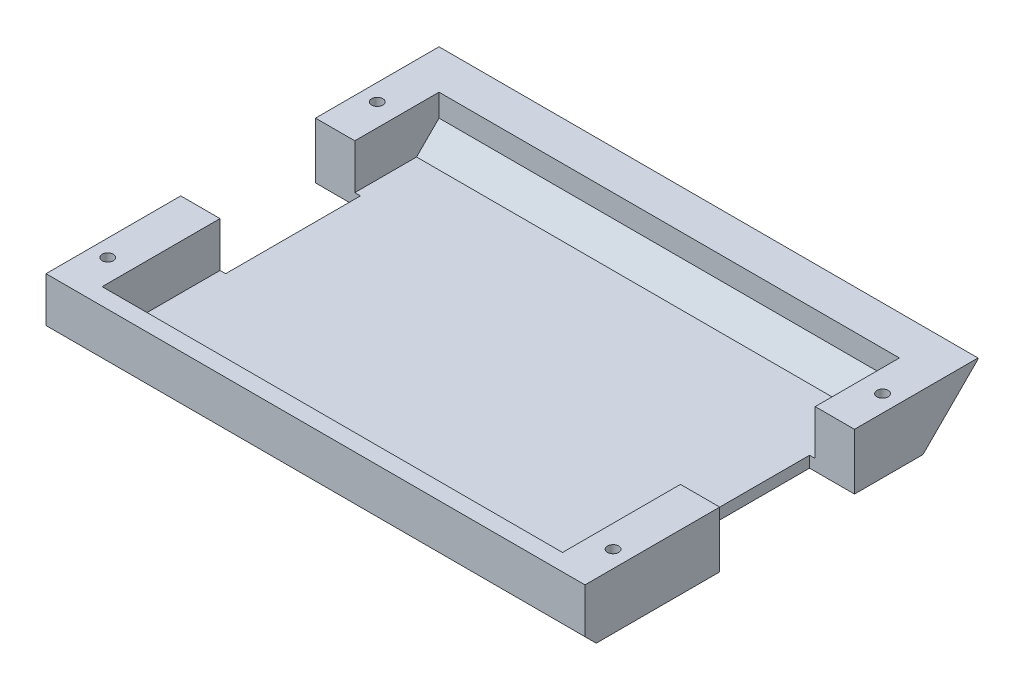
ISO-10303-21;
HEADER;
FILE_DESCRIPTION(('STEP AP214'),'2;1');
FILE_NAME('part.step','',(''),(''),'','','');
FILE_SCHEMA(('AUTOMOTIVE_DESIGN { 1 0 10303 214 1 1 1 1 }'));
ENDSEC;
DATA;
#1=APPLICATION_CONTEXT('core data for automotive mechanical design processes');
#2=APPLICATION_PROTOCOL_DEFINITION('international standard','automotive_design',2000,#1);
#3=PRODUCT_CONTEXT('',#1,'mechanical');
#4=PRODUCT('Part','Part','',(#3));
#5=PRODUCT_RELATED_PRODUCT_CATEGORY('part','',(#4));
#6=PRODUCT_DEFINITION_FORMATION('','',#4);
#7=PRODUCT_DEFINITION_CONTEXT('part definition',#1,'design');
#8=PRODUCT_DEFINITION('design','',#6,#7);
#9=PRODUCT_DEFINITION_SHAPE('','',#8);
#10=(LENGTH_UNIT() NAMED_UNIT(*) SI_UNIT(.MILLI.,.METRE.));
#11=(NAMED_UNIT(*) PLANE_ANGLE_UNIT() SI_UNIT($,.RADIAN.));
#12=(NAMED_UNIT(*) SI_UNIT($,.STERADIAN.) SOLID_ANGLE_UNIT());
#13=UNCERTAINTY_MEASURE_WITH_UNIT(LENGTH_MEASURE(1.E-05),#10,'distance_accuracy_value','');
#14=(GEOMETRIC_REPRESENTATION_CONTEXT(3) GLOBAL_UNCERTAINTY_ASSIGNED_CONTEXT((#13)) GLOBAL_UNIT_ASSIGNED_CONTEXT((#10,
#11,#12)) REPRESENTATION_CONTEXT('',''));
#15=CARTESIAN_POINT('',(0.,0.,0.));
#16=DIRECTION('',(0.,0.,1.));
#17=DIRECTION('',(1.,0.,0.));
#18=AXIS2_PLACEMENT_3D('',#15,#16,#17);
#19=CARTESIAN_POINT('',(-24.,5.,17.5));
#20=DIRECTION('',(1.,0.,0.));
#21=DIRECTION('',(0.,0.,-1.));
#22=AXIS2_PLACEMENT_3D('',#19,#20,#21);
#23=PLANE('',#22);
#24=DIRECTION('',(0.,-1.,0.));
#25=VECTOR('',#24,1.);
#26=CARTESIAN_POINT('',(-24.,5.,-17.5));
#27=LINE('',#26,#25);
#28=CARTESIAN_POINT('',(-24.,5.,-17.5));
#29=VERTEX_POINT('',#28);
#30=CARTESIAN_POINT('',(-24.,4.9,-17.5));
#31=VERTEX_POINT('',#30);
#32=EDGE_CURVE('E238',#29,#31,#27,.T.);
#33=ORIENTED_EDGE('',*,*,#32,.T.);
#34=DIRECTION('',(0.,0.707106781186547,-0.707106781186549));
#35=VECTOR('',#34,1.);
#36=CARTESIAN_POINT('',(-24.,4.9,-17.5));
#37=LINE('',#36,#35);
#38=CARTESIAN_POINT('',(-24.,0.,-12.6));
#39=VERTEX_POINT('',#38);
#40=EDGE_CURVE('E296',#31,#39,#37,.F.);
#41=ORIENTED_EDGE('',*,*,#40,.T.);
#42=DIRECTION('',(0.,0.,1.));
#43=VECTOR('',#42,1.);
#44=CARTESIAN_POINT('',(-24.,0.,17.5));
#45=LINE('',#44,#43);
#46=CARTESIAN_POINT('',(-24.,0.,-6.5));
#47=VERTEX_POINT('',#46);
#48=EDGE_CURVE('E223',#39,#47,#45,.T.);
#49=ORIENTED_EDGE('',*,*,#48,.T.);
#50=DIRECTION('',(0.,1.,0.));
#51=VECTOR('',#50,1.);
#52=CARTESIAN_POINT('',(-24.,0.,-6.5));
#53=LINE('',#52,#51);
#54=CARTESIAN_POINT('',(-24.,5.,-6.5));
#55=VERTEX_POINT('',#54);
#56=EDGE_CURVE('E361',#47,#55,#53,.T.);
#57=ORIENTED_EDGE('',*,*,#56,.T.);
#58=DIRECTION('',(0.,0.,1.));
#59=VECTOR('',#58,1.);
#60=CARTESIAN_POINT('',(-24.,5.,17.5));
#61=LINE('',#60,#59);
#62=EDGE_CURVE('E332',#29,#55,#61,.T.);
#63=ORIENTED_EDGE('',*,*,#62,.F.);
#64=EDGE_LOOP('',(#33,#41,#49,#57,#63));
#65=FACE_BOUND('',#64,.T.);
#66=ADVANCED_FACE('F39',(#65),#23,.F.);
#67=CARTESIAN_POINT('',(24.,5.,17.5));
#68=DIRECTION('',(-1.,0.,0.));
#69=DIRECTION('',(0.,0.,1.));
#70=AXIS2_PLACEMENT_3D('',#67,#68,#69);
#71=PLANE('',#70);
#72=DIRECTION('',(0.,0.,-1.));
#73=VECTOR('',#72,1.);
#74=CARTESIAN_POINT('',(24.,0.,17.5));
#75=LINE('',#74,#73);
#76=CARTESIAN_POINT('',(24.,0.,-6.5));
#77=VERTEX_POINT('',#76);
#78=CARTESIAN_POINT('',(24.,0.,-12.6));
#79=VERTEX_POINT('',#78);
#80=EDGE_CURVE('E228',#77,#79,#75,.T.);
#81=ORIENTED_EDGE('',*,*,#80,.T.);
#82=DIRECTION('',(0.,-0.707106781186547,0.707106781186549));
#83=VECTOR('',#82,1.);
#84=CARTESIAN_POINT('',(24.,4.9,-17.5));
#85=LINE('',#84,#83);
#86=CARTESIAN_POINT('',(24.,4.9,-17.5));
#87=VERTEX_POINT('',#86);
#88=EDGE_CURVE('E302',#79,#87,#85,.F.);
#89=ORIENTED_EDGE('',*,*,#88,.T.);
#90=DIRECTION('',(0.,-1.,0.));
#91=VECTOR('',#90,1.);
#92=CARTESIAN_POINT('',(24.,5.,-17.5));
#93=LINE('',#92,#91);
#94=CARTESIAN_POINT('',(24.,5.,-17.5));
#95=VERTEX_POINT('',#94);
#96=EDGE_CURVE('E242',#95,#87,#93,.T.);
#97=ORIENTED_EDGE('',*,*,#96,.F.);
#98=DIRECTION('',(0.,0.,-1.));
#99=VECTOR('',#98,1.);
#100=CARTESIAN_POINT('',(24.,5.,17.5));
#101=LINE('',#100,#99);
#102=CARTESIAN_POINT('',(24.,5.,-6.5));
#103=VERTEX_POINT('',#102);
#104=EDGE_CURVE('E328',#103,#95,#101,.T.);
#105=ORIENTED_EDGE('',*,*,#104,.F.);
#106=DIRECTION('',(0.,1.,0.));
#107=VECTOR('',#106,1.);
#108=CARTESIAN_POINT('',(24.,0.,-6.5));
#109=LINE('',#108,#107);
#110=EDGE_CURVE('E346',#77,#103,#109,.T.);
#111=ORIENTED_EDGE('',*,*,#110,.F.);
#112=EDGE_LOOP('',(#81,#89,#97,#105,#111));
#113=FACE_BOUND('',#112,.T.);
#114=ADVANCED_FACE('F343',(#113),#71,.F.);
#115=CARTESIAN_POINT('',(0.,5.,0.));
#116=DIRECTION('',(0.,1.,0.));
#117=DIRECTION('',(0.,0.,1.));
#118=AXIS2_PLACEMENT_3D('',#115,#116,#117);
#119=PLANE('',#118);
#120=DIRECTION('',(-1.,0.,0.));
#121=VECTOR('',#120,1.);
#122=CARTESIAN_POINT('',(-20.,5.,-6.5));
#123=LINE('',#122,#121);
#124=CARTESIAN_POINT('',(-20.5,5.,-6.5));
#125=VERTEX_POINT('',#124);
#126=EDGE_CURVE('E205',#125,#55,#123,.T.);
#127=ORIENTED_EDGE('',*,*,#126,.F.);
#128=DIRECTION('',(0.,0.,1.));
#129=VECTOR('',#128,1.);
#130=CARTESIAN_POINT('',(-20.5,5.,16.));
#131=LINE('',#130,#129);
#132=CARTESIAN_POINT('',(-20.5,5.,-14.));
#133=VERTEX_POINT('',#132);
#134=EDGE_CURVE('E479',#133,#125,#131,.T.);
#135=ORIENTED_EDGE('',*,*,#134,.F.);
#136=DIRECTION('',(-1.,0.,0.));
#137=VECTOR('',#136,1.);
#138=CARTESIAN_POINT('',(20.5,5.,-14.));
#139=LINE('',#138,#137);
#140=CARTESIAN_POINT('',(20.5,5.,-14.));
#141=VERTEX_POINT('',#140);
#142=EDGE_CURVE('E490',#141,#133,#139,.T.);
#143=ORIENTED_EDGE('',*,*,#142,.F.);
#144=DIRECTION('',(0.,0.,-1.));
#145=VECTOR('',#144,1.);
#146=CARTESIAN_POINT('',(20.5,5.,16.));
#147=LINE('',#146,#145);
#148=CARTESIAN_POINT('',(20.5,5.,-6.5));
#149=VERTEX_POINT('',#148);
#150=EDGE_CURVE('E373',#149,#141,#147,.T.);
#151=ORIENTED_EDGE('',*,*,#150,.F.);
#152=DIRECTION('',(-1.,0.,0.));
#153=VECTOR('',#152,1.);
#154=CARTESIAN_POINT('',(20.,5.,-6.5));
#155=LINE('',#154,#153);
#156=EDGE_CURVE('E370',#103,#149,#155,.T.);
#157=ORIENTED_EDGE('',*,*,#156,.F.);
#158=ORIENTED_EDGE('',*,*,#104,.T.);
#159=DIRECTION('',(-1.,0.,0.));
#160=VECTOR('',#159,1.);
#161=CARTESIAN_POINT('',(24.,5.,-17.5));
#162=LINE('',#161,#160);
#163=EDGE_CURVE('E233',#95,#29,#162,.T.);
#164=ORIENTED_EDGE('',*,*,#163,.T.);
#165=ORIENTED_EDGE('',*,*,#62,.T.);
#166=EDGE_LOOP('',(#127,#135,#143,#151,#157,#158,#164,#165));
#167=FACE_BOUND('',#166,.T.);
#168=CARTESIAN_POINT('',(-22.5,5.,-10.5));
#169=DIRECTION('',(0.,1.,0.));
#170=DIRECTION('',(0.,0.,1.));
#171=AXIS2_PLACEMENT_3D('',#168,#169,#170);
#172=CIRCLE('',#171,0.499999999999999);
#173=CARTESIAN_POINT('',(-22.5,5.,-10.));
#174=VERTEX_POINT('',#173);
#175=EDGE_CURVE('E453',#174,#174,#172,.T.);
#176=ORIENTED_EDGE('',*,*,#175,.F.);
#177=EDGE_LOOP('',(#176));
#178=FACE_BOUND('',#177,.T.);
#179=CARTESIAN_POINT('',(22.5,5.,-10.5));
#180=DIRECTION('',(0.,1.,0.));
#181=DIRECTION('',(0.,0.,-1.));
#182=AXIS2_PLACEMENT_3D('',#179,#180,#181);
#183=CIRCLE('',#182,0.499999999999999);
#184=CARTESIAN_POINT('',(22.5,5.,-11.));
#185=VERTEX_POINT('',#184);
#186=EDGE_CURVE('E454',#185,#185,#183,.T.);
#187=ORIENTED_EDGE('',*,*,#186,.F.);
#188=EDGE_LOOP('',(#187));
#189=FACE_BOUND('',#188,.T.);
#190=ADVANCED_FACE('F364',(#167,#178,#189),#119,.T.);
#191=CARTESIAN_POINT('',(-20.5,1.,16.));
#192=DIRECTION('',(-1.,0.,0.));
#193=DIRECTION('',(0.,0.,1.));
#194=AXIS2_PLACEMENT_3D('',#191,#192,#193);
#195=PLANE('',#194);
#196=DIRECTION('',(0.,0.,1.));
#197=VECTOR('',#196,1.);
#198=CARTESIAN_POINT('',(-20.5,1.,16.));
#199=LINE('',#198,#197);
#200=CARTESIAN_POINT('',(-20.5,1.,-12.));
#201=VERTEX_POINT('',#200);
#202=CARTESIAN_POINT('',(-20.5,1.,-6.5));
#203=VERTEX_POINT('',#202);
#204=EDGE_CURVE('E465',#201,#203,#199,.T.);
#205=ORIENTED_EDGE('',*,*,#204,.F.);
#206=DIRECTION('',(0.,0.707106781186544,-0.707106781186551));
#207=VECTOR('',#206,1.);
#208=CARTESIAN_POINT('',(-20.5,1.,-12.));
#209=LINE('',#208,#207);
#210=CARTESIAN_POINT('',(-20.5,2.99999999999999,-14.));
#211=VERTEX_POINT('',#210);
#212=EDGE_CURVE('E62',#201,#211,#209,.T.);
#213=ORIENTED_EDGE('',*,*,#212,.T.);
#214=DIRECTION('',(0.,1.,0.));
#215=VECTOR('',#214,1.);
#216=CARTESIAN_POINT('',(-20.5,1.,-14.));
#217=LINE('',#216,#215);
#218=EDGE_CURVE('E224',#211,#133,#217,.T.);
#219=ORIENTED_EDGE('',*,*,#218,.T.);
#220=ORIENTED_EDGE('',*,*,#134,.T.);
#221=DIRECTION('',(0.,-1.,0.));
#222=VECTOR('',#221,1.);
#223=CARTESIAN_POINT('',(-20.5,1.,-6.5));
#224=LINE('',#223,#222);
#225=EDGE_CURVE('E414',#125,#203,#224,.T.);
#226=ORIENTED_EDGE('',*,*,#225,.T.);
#227=EDGE_LOOP('',(#205,#213,#219,#220,#226));
#228=FACE_BOUND('',#227,.T.);
#229=ADVANCED_FACE('F613',(#228),#195,.F.);
#230=CARTESIAN_POINT('',(20.5,1.,16.));
#231=DIRECTION('',(1.,0.,0.));
#232=DIRECTION('',(0.,0.,-1.));
#233=AXIS2_PLACEMENT_3D('',#230,#231,#232);
#234=PLANE('',#233);
#235=DIRECTION('',(0.,1.,0.));
#236=VECTOR('',#235,1.);
#237=CARTESIAN_POINT('',(20.5,1.,-14.));
#238=LINE('',#237,#236);
#239=CARTESIAN_POINT('',(20.5,2.99999999999999,-14.));
#240=VERTEX_POINT('',#239);
#241=EDGE_CURVE('E229',#240,#141,#238,.T.);
#242=ORIENTED_EDGE('',*,*,#241,.F.);
#243=DIRECTION('',(0.,-0.707106781186544,0.707106781186551));
#244=VECTOR('',#243,1.);
#245=CARTESIAN_POINT('',(20.5,0.999999999999999,-12.));
#246=LINE('',#245,#244);
#247=CARTESIAN_POINT('',(20.5,1.,-12.));
#248=VERTEX_POINT('',#247);
#249=EDGE_CURVE('E11',#240,#248,#246,.T.);
#250=ORIENTED_EDGE('',*,*,#249,.T.);
#251=DIRECTION('',(0.,0.,-1.));
#252=VECTOR('',#251,1.);
#253=CARTESIAN_POINT('',(20.5,1.,16.));
#254=LINE('',#253,#252);
#255=CARTESIAN_POINT('',(20.5,1.,-6.5));
#256=VERTEX_POINT('',#255);
#257=EDGE_CURVE('E473',#256,#248,#254,.T.);
#258=ORIENTED_EDGE('',*,*,#257,.F.);
#259=DIRECTION('',(0.,1.,0.));
#260=VECTOR('',#259,1.);
#261=CARTESIAN_POINT('',(20.5,1.,-6.50000000000001));
#262=LINE('',#261,#260);
#263=EDGE_CURVE('E407',#256,#149,#262,.T.);
#264=ORIENTED_EDGE('',*,*,#263,.T.);
#265=ORIENTED_EDGE('',*,*,#150,.T.);
#266=EDGE_LOOP('',(#242,#250,#258,#264,#265));
#267=FACE_BOUND('',#266,.T.);
#268=ADVANCED_FACE('F598',(#267),#234,.F.);
#269=CARTESIAN_POINT('',(-22.5,0.,-10.5));
#270=DIRECTION('',(0.,1.,0.));
#271=DIRECTION('',(0.,0.,1.));
#272=AXIS2_PLACEMENT_3D('',#269,#270,#271);
#273=CYLINDRICAL_SURFACE('',#272,0.499999999999999);
#274=ORIENTED_EDGE('',*,*,#175,.T.);
#275=EDGE_LOOP('',(#274));
#276=FACE_BOUND('',#275,.T.);
#277=CARTESIAN_POINT('',(-22.5,4.,-10.5));
#278=DIRECTION('',(0.,-1.,0.));
#279=DIRECTION('',(0.,0.,-1.));
#280=AXIS2_PLACEMENT_3D('',#277,#278,#279);
#281=CIRCLE('',#280,0.499999999999999);
#282=CARTESIAN_POINT('',(-22.5,4.,-11.));
#283=VERTEX_POINT('',#282);
#284=EDGE_CURVE('E268',#283,#283,#281,.F.);
#285=ORIENTED_EDGE('',*,*,#284,.F.);
#286=EDGE_LOOP('',(#285));
#287=FACE_BOUND('',#286,.T.);
#288=ADVANCED_FACE('F595',(#276,#287),#273,.F.);
#289=CARTESIAN_POINT('',(22.5,0.,13.5));
#290=DIRECTION('',(0.,1.,0.));
#291=DIRECTION('',(0.,0.,1.));
#292=AXIS2_PLACEMENT_3D('',#289,#290,#291);
#293=CYLINDRICAL_SURFACE('',#292,0.499999999999999);
#294=CARTESIAN_POINT('',(22.5,5.,13.5));
#295=DIRECTION('',(0.,1.,0.));
#296=DIRECTION('',(0.,0.,1.));
#297=AXIS2_PLACEMENT_3D('',#294,#295,#296);
#298=CIRCLE('',#297,0.499999999999999);
#299=CARTESIAN_POINT('',(22.5,5.,14.));
#300=VERTEX_POINT('',#299);
#301=EDGE_CURVE('E449',#300,#300,#298,.T.);
#302=ORIENTED_EDGE('',*,*,#301,.T.);
#303=EDGE_LOOP('',(#302));
#304=FACE_BOUND('',#303,.T.);
#305=CARTESIAN_POINT('',(22.5,4.,13.5));
#306=DIRECTION('',(0.,-1.,0.));
#307=DIRECTION('',(0.,0.,-1.));
#308=AXIS2_PLACEMENT_3D('',#305,#306,#307);
#309=CIRCLE('',#308,0.499999999999999);
#310=CARTESIAN_POINT('',(22.5,4.,13.));
#311=VERTEX_POINT('',#310);
#312=EDGE_CURVE('E264',#311,#311,#309,.F.);
#313=ORIENTED_EDGE('',*,*,#312,.F.);
#314=EDGE_LOOP('',(#313));
#315=FACE_BOUND('',#314,.T.);
#316=ADVANCED_FACE('F589',(#304,#315),#293,.F.);
#317=CARTESIAN_POINT('',(22.5,0.,-10.5));
#318=DIRECTION('',(0.,1.,0.));
#319=DIRECTION('',(0.,0.,1.));
#320=AXIS2_PLACEMENT_3D('',#317,#318,#319);
#321=CYLINDRICAL_SURFACE('',#320,0.499999999999999);
#322=ORIENTED_EDGE('',*,*,#186,.T.);
#323=EDGE_LOOP('',(#322));
#324=FACE_BOUND('',#323,.T.);
#325=CARTESIAN_POINT('',(22.5,4.,-10.5));
#326=DIRECTION('',(0.,-1.,0.));
#327=DIRECTION('',(0.,0.,-1.));
#328=AXIS2_PLACEMENT_3D('',#325,#326,#327);
#329=CIRCLE('',#328,0.499999999999999);
#330=CARTESIAN_POINT('',(22.5,4.,-11.));
#331=VERTEX_POINT('',#330);
#332=EDGE_CURVE('E259',#331,#331,#329,.F.);
#333=ORIENTED_EDGE('',*,*,#332,.F.);
#334=EDGE_LOOP('',(#333));
#335=FACE_BOUND('',#334,.T.);
#336=ADVANCED_FACE('F583',(#324,#335),#321,.F.);
#337=CARTESIAN_POINT('',(-22.5,0.,13.5));
#338=DIRECTION('',(0.,1.,0.));
#339=DIRECTION('',(0.,0.,1.));
#340=AXIS2_PLACEMENT_3D('',#337,#338,#339);
#341=CYLINDRICAL_SURFACE('',#340,0.499999999999999);
#342=CARTESIAN_POINT('',(-22.5,5.,13.5));
#343=DIRECTION('',(0.,1.,0.));
#344=DIRECTION('',(0.,0.,-1.));
#345=AXIS2_PLACEMENT_3D('',#342,#343,#344);
#346=CIRCLE('',#345,0.499999999999999);
#347=CARTESIAN_POINT('',(-22.5,5.,13.));
#348=VERTEX_POINT('',#347);
#349=EDGE_CURVE('E272',#348,#348,#346,.T.);
#350=ORIENTED_EDGE('',*,*,#349,.T.);
#351=EDGE_LOOP('',(#350));
#352=FACE_BOUND('',#351,.T.);
#353=CARTESIAN_POINT('',(-22.5,4.,13.5));
#354=DIRECTION('',(0.,-1.,0.));
#355=DIRECTION('',(0.,0.,-1.));
#356=AXIS2_PLACEMENT_3D('',#353,#354,#355);
#357=CIRCLE('',#356,0.499999999999999);
#358=CARTESIAN_POINT('',(-22.5,4.,13.));
#359=VERTEX_POINT('',#358);
#360=EDGE_CURVE('E255',#359,#359,#357,.F.);
#361=ORIENTED_EDGE('',*,*,#360,.F.);
#362=EDGE_LOOP('',(#361));
#363=FACE_BOUND('',#362,.T.);
#364=ADVANCED_FACE('F578',(#352,#363),#341,.F.);
#365=CARTESIAN_POINT('',(-24.,0.,5.5));
#366=VERTEX_POINT('',#365);
#367=CARTESIAN_POINT('',(-24.,0.,16.5));
#368=VERTEX_POINT('',#367);
#369=EDGE_CURVE('E211',#366,#368,#45,.T.);
#370=ORIENTED_EDGE('',*,*,#369,.T.);
#371=DIRECTION('',(0.,-0.707106781186548,-0.707106781186548));
#372=VECTOR('',#371,1.);
#373=CARTESIAN_POINT('',(-24.,1.00000000000001,17.5));
#374=LINE('',#373,#372);
#375=CARTESIAN_POINT('',(-24.,1.00000000000001,17.5));
#376=VERTEX_POINT('',#375);
#377=EDGE_CURVE('E314',#368,#376,#374,.F.);
#378=ORIENTED_EDGE('',*,*,#377,.T.);
#379=DIRECTION('',(0.,-1.,0.));
#380=VECTOR('',#379,1.);
#381=CARTESIAN_POINT('',(-24.,5.,17.5));
#382=LINE('',#381,#380);
#383=CARTESIAN_POINT('',(-24.,5.,17.5));
#384=VERTEX_POINT('',#383);
#385=EDGE_CURVE('E250',#384,#376,#382,.T.);
#386=ORIENTED_EDGE('',*,*,#385,.F.);
#387=CARTESIAN_POINT('',(-24.,5.,5.5));
#388=VERTEX_POINT('',#387);
#389=EDGE_CURVE('E214',#388,#384,#61,.T.);
#390=ORIENTED_EDGE('',*,*,#389,.F.);
#391=DIRECTION('',(0.,1.,0.));
#392=VECTOR('',#391,1.);
#393=CARTESIAN_POINT('',(-24.,0.,5.5));
#394=LINE('',#393,#392);
#395=EDGE_CURVE('E195',#366,#388,#394,.T.);
#396=ORIENTED_EDGE('',*,*,#395,.F.);
#397=EDGE_LOOP('',(#370,#378,#386,#390,#396));
#398=FACE_BOUND('',#397,.T.);
#399=ADVANCED_FACE('F210',(#398),#23,.F.);
#400=CARTESIAN_POINT('',(24.,5.,17.5));
#401=DIRECTION('',(0.,0.,-1.));
#402=DIRECTION('',(-1.,0.,0.));
#403=AXIS2_PLACEMENT_3D('',#400,#401,#402);
#404=PLANE('',#403);
#405=ORIENTED_EDGE('',*,*,#385,.T.);
#406=DIRECTION('',(1.,0.,0.));
#407=VECTOR('',#406,1.);
#408=CARTESIAN_POINT('',(24.,1.00000000000001,17.5));
#409=LINE('',#408,#407);
#410=CARTESIAN_POINT('',(24.,1.00000000000001,17.5));
#411=VERTEX_POINT('',#410);
#412=EDGE_CURVE('E305',#376,#411,#409,.T.);
#413=ORIENTED_EDGE('',*,*,#412,.T.);
#414=DIRECTION('',(0.,-1.,0.));
#415=VECTOR('',#414,1.);
#416=CARTESIAN_POINT('',(24.,5.,17.5));
#417=LINE('',#416,#415);
#418=CARTESIAN_POINT('',(24.,5.,17.5));
#419=VERTEX_POINT('',#418);
#420=EDGE_CURVE('E246',#419,#411,#417,.T.);
#421=ORIENTED_EDGE('',*,*,#420,.F.);
#422=DIRECTION('',(1.,0.,0.));
#423=VECTOR('',#422,1.);
#424=CARTESIAN_POINT('',(24.,5.,17.5));
#425=LINE('',#424,#423);
#426=EDGE_CURVE('E330',#384,#419,#425,.T.);
#427=ORIENTED_EDGE('',*,*,#426,.F.);
#428=EDGE_LOOP('',(#405,#413,#421,#427));
#429=FACE_BOUND('',#428,.T.);
#430=ADVANCED_FACE('F558',(#429),#404,.F.);
#431=ORIENTED_EDGE('',*,*,#420,.T.);
#432=DIRECTION('',(0.,0.707106781186548,0.707106781186548));
#433=VECTOR('',#432,1.);
#434=CARTESIAN_POINT('',(24.,1.00000000000001,17.5));
#435=LINE('',#434,#433);
#436=CARTESIAN_POINT('',(24.,0.,16.5));
#437=VERTEX_POINT('',#436);
#438=EDGE_CURVE('E309',#411,#437,#435,.F.);
#439=ORIENTED_EDGE('',*,*,#438,.T.);
#440=CARTESIAN_POINT('',(24.,0.,5.5));
#441=VERTEX_POINT('',#440);
#442=EDGE_CURVE('E235',#437,#441,#75,.T.);
#443=ORIENTED_EDGE('',*,*,#442,.T.);
#444=DIRECTION('',(0.,1.,0.));
#445=VECTOR('',#444,1.);
#446=CARTESIAN_POINT('',(24.,0.,5.5));
#447=LINE('',#446,#445);
#448=CARTESIAN_POINT('',(24.,5.,5.5));
#449=VERTEX_POINT('',#448);
#450=EDGE_CURVE('E395',#441,#449,#447,.T.);
#451=ORIENTED_EDGE('',*,*,#450,.T.);
#452=EDGE_CURVE('E325',#419,#449,#101,.T.);
#453=ORIENTED_EDGE('',*,*,#452,.F.);
#454=EDGE_LOOP('',(#431,#439,#443,#451,#453));
#455=FACE_BOUND('',#454,.T.);
#456=ADVANCED_FACE('F554',(#455),#71,.F.);
#457=CARTESIAN_POINT('',(24.,5.,-17.5));
#458=DIRECTION('',(0.,0.,1.));
#459=DIRECTION('',(1.,0.,0.));
#460=AXIS2_PLACEMENT_3D('',#457,#458,#459);
#461=PLANE('',#460);
#462=ORIENTED_EDGE('',*,*,#96,.T.);
#463=DIRECTION('',(-1.,0.,0.));
#464=VECTOR('',#463,1.);
#465=CARTESIAN_POINT('',(24.,4.9,-17.5));
#466=LINE('',#465,#464);
#467=EDGE_CURVE('E292',#87,#31,#466,.T.);
#468=ORIENTED_EDGE('',*,*,#467,.T.);
#469=ORIENTED_EDGE('',*,*,#32,.F.);
#470=ORIENTED_EDGE('',*,*,#163,.F.);
#471=EDGE_LOOP('',(#462,#468,#469,#470));
#472=FACE_BOUND('',#471,.T.);
#473=ADVANCED_FACE('F354',(#472),#461,.F.);
#474=DIRECTION('',(1.,0.,0.));
#475=VECTOR('',#474,1.);
#476=CARTESIAN_POINT('',(-20.,5.,5.5));
#477=LINE('',#476,#475);
#478=CARTESIAN_POINT('',(-20.5,5.,5.5));
#479=VERTEX_POINT('',#478);
#480=EDGE_CURVE('E392',#388,#479,#477,.T.);
#481=ORIENTED_EDGE('',*,*,#480,.F.);
#482=ORIENTED_EDGE('',*,*,#389,.T.);
#483=ORIENTED_EDGE('',*,*,#426,.T.);
#484=ORIENTED_EDGE('',*,*,#452,.T.);
#485=DIRECTION('',(1.,0.,0.));
#486=VECTOR('',#485,1.);
#487=CARTESIAN_POINT('',(20.,5.,5.5));
#488=LINE('',#487,#486);
#489=CARTESIAN_POINT('',(20.5,5.,5.5));
#490=VERTEX_POINT('',#489);
#491=EDGE_CURVE('E378',#490,#449,#488,.T.);
#492=ORIENTED_EDGE('',*,*,#491,.F.);
#493=CARTESIAN_POINT('',(20.5,5.,16.));
#494=VERTEX_POINT('',#493);
#495=EDGE_CURVE('E486',#494,#490,#147,.T.);
#496=ORIENTED_EDGE('',*,*,#495,.F.);
#497=DIRECTION('',(1.,0.,0.));
#498=VECTOR('',#497,1.);
#499=CARTESIAN_POINT('',(20.5,5.,16.));
#500=LINE('',#499,#498);
#501=CARTESIAN_POINT('',(-20.5,5.,16.));
#502=VERTEX_POINT('',#501);
#503=EDGE_CURVE('E482',#502,#494,#500,.T.);
#504=ORIENTED_EDGE('',*,*,#503,.F.);
#505=EDGE_CURVE('E464',#479,#502,#131,.T.);
#506=ORIENTED_EDGE('',*,*,#505,.F.);
#507=EDGE_LOOP('',(#481,#482,#483,#484,#492,#496,#504,#506));
#508=FACE_BOUND('',#507,.T.);
#509=ORIENTED_EDGE('',*,*,#349,.F.);
#510=EDGE_LOOP('',(#509));
#511=FACE_BOUND('',#510,.T.);
#512=ORIENTED_EDGE('',*,*,#301,.F.);
#513=EDGE_LOOP('',(#512));
#514=FACE_BOUND('',#513,.T.);
#515=ADVANCED_FACE('F511',(#508,#511,#514),#119,.T.);
#516=CARTESIAN_POINT('',(0.,0.,0.));
#517=DIRECTION('',(0.,1.,0.));
#518=DIRECTION('',(0.,0.,1.));
#519=AXIS2_PLACEMENT_3D('',#516,#517,#518);
#520=PLANE('',#519);
#521=CARTESIAN_POINT('',(22.5,0.,-10.5));
#522=DIRECTION('',(0.,-1.,0.));
#523=DIRECTION('',(0.,0.,-1.));
#524=AXIS2_PLACEMENT_3D('',#521,#522,#523);
#525=CIRCLE('',#524,1.);
#526=CARTESIAN_POINT('',(22.5,0.,-11.5));
#527=VERTEX_POINT('',#526);
#528=EDGE_CURVE('E418',#527,#527,#525,.T.);
#529=ORIENTED_EDGE('',*,*,#528,.F.);
#530=EDGE_LOOP('',(#529));
#531=FACE_BOUND('',#530,.T.);
#532=CARTESIAN_POINT('',(-22.5,0.,13.5));
#533=DIRECTION('',(0.,-1.,0.));
#534=DIRECTION('',(0.,0.,-1.));
#535=AXIS2_PLACEMENT_3D('',#532,#533,#534);
#536=CIRCLE('',#535,1.);
#537=CARTESIAN_POINT('',(-22.5,0.,12.5));
#538=VERTEX_POINT('',#537);
#539=EDGE_CURVE('E432',#538,#538,#536,.T.);
#540=ORIENTED_EDGE('',*,*,#539,.F.);
#541=EDGE_LOOP('',(#540));
#542=FACE_BOUND('',#541,.T.);
#543=CARTESIAN_POINT('',(22.5,0.,13.5));
#544=DIRECTION('',(0.,-1.,0.));
#545=DIRECTION('',(0.,0.,-1.));
#546=AXIS2_PLACEMENT_3D('',#543,#544,#545);
#547=CIRCLE('',#546,1.);
#548=CARTESIAN_POINT('',(22.5,0.,12.5));
#549=VERTEX_POINT('',#548);
#550=EDGE_CURVE('E424',#549,#549,#547,.T.);
#551=ORIENTED_EDGE('',*,*,#550,.F.);
#552=EDGE_LOOP('',(#551));
#553=FACE_BOUND('',#552,.T.);
#554=CARTESIAN_POINT('',(-22.5,0.,-10.5));
#555=DIRECTION('',(0.,-1.,0.));
#556=DIRECTION('',(0.,0.,-1.));
#557=AXIS2_PLACEMENT_3D('',#554,#555,#556);
#558=CIRCLE('',#557,1.);
#559=CARTESIAN_POINT('',(-22.5,0.,-11.5));
#560=VERTEX_POINT('',#559);
#561=EDGE_CURVE('E423',#560,#560,#558,.T.);
#562=ORIENTED_EDGE('',*,*,#561,.F.);
#563=EDGE_LOOP('',(#562));
#564=FACE_BOUND('',#563,.T.);
#565=ORIENTED_EDGE('',*,*,#442,.F.);
#566=DIRECTION('',(-1.,0.,0.));
#567=VECTOR('',#566,1.);
#568=CARTESIAN_POINT('',(0.,0.,16.5));
#569=LINE('',#568,#567);
#570=EDGE_CURVE('E221',#437,#368,#569,.T.);
#571=ORIENTED_EDGE('',*,*,#570,.T.);
#572=ORIENTED_EDGE('',*,*,#369,.F.);
#573=DIRECTION('',(1.,0.,0.));
#574=VECTOR('',#573,1.);
#575=CARTESIAN_POINT('',(-20.,0.,5.5));
#576=LINE('',#575,#574);
#577=CARTESIAN_POINT('',(-20.,0.,5.5));
#578=VERTEX_POINT('',#577);
#579=EDGE_CURVE('E192',#366,#578,#576,.T.);
#580=ORIENTED_EDGE('',*,*,#579,.T.);
#581=DIRECTION('',(0.,0.,-1.));
#582=VECTOR('',#581,1.);
#583=CARTESIAN_POINT('',(-20.,0.,5.5));
#584=LINE('',#583,#582);
#585=CARTESIAN_POINT('',(-20.,0.,-6.5));
#586=VERTEX_POINT('',#585);
#587=EDGE_CURVE('E204',#578,#586,#584,.T.);
#588=ORIENTED_EDGE('',*,*,#587,.T.);
#589=DIRECTION('',(-1.,0.,0.));
#590=VECTOR('',#589,1.);
#591=CARTESIAN_POINT('',(-20.,0.,-6.5));
#592=LINE('',#591,#590);
#593=EDGE_CURVE('E216',#586,#47,#592,.T.);
#594=ORIENTED_EDGE('',*,*,#593,.T.);
#595=ORIENTED_EDGE('',*,*,#48,.F.);
#596=DIRECTION('',(1.,0.,0.));
#597=VECTOR('',#596,1.);
#598=CARTESIAN_POINT('',(0.,0.,-12.6));
#599=LINE('',#598,#597);
#600=EDGE_CURVE('E299',#39,#79,#599,.T.);
#601=ORIENTED_EDGE('',*,*,#600,.T.);
#602=ORIENTED_EDGE('',*,*,#80,.F.);
#603=DIRECTION('',(-1.,0.,0.));
#604=VECTOR('',#603,1.);
#605=CARTESIAN_POINT('',(20.,0.,-6.5));
#606=LINE('',#605,#604);
#607=CARTESIAN_POINT('',(20.,0.,-6.5));
#608=VERTEX_POINT('',#607);
#609=EDGE_CURVE('E402',#77,#608,#606,.T.);
#610=ORIENTED_EDGE('',*,*,#609,.T.);
#611=DIRECTION('',(0.,0.,1.));
#612=VECTOR('',#611,1.);
#613=CARTESIAN_POINT('',(20.,0.,5.5));
#614=LINE('',#613,#612);
#615=CARTESIAN_POINT('',(20.,0.,5.5));
#616=VERTEX_POINT('',#615);
#617=EDGE_CURVE('E377',#608,#616,#614,.T.);
#618=ORIENTED_EDGE('',*,*,#617,.T.);
#619=DIRECTION('',(1.,0.,0.));
#620=VECTOR('',#619,1.);
#621=CARTESIAN_POINT('',(20.,0.,5.5));
#622=LINE('',#621,#620);
#623=EDGE_CURVE('E383',#616,#441,#622,.T.);
#624=ORIENTED_EDGE('',*,*,#623,.T.);
#625=EDGE_LOOP('',(#565,#571,#572,#580,#588,#594,#595,#601,#602,#610,#618,#624));
#626=FACE_BOUND('',#625,.T.);
#627=ADVANCED_FACE('F219',(#531,#542,#553,#564,#626),#520,.F.);
#628=CARTESIAN_POINT('',(-20.5,1.,5.5));
#629=VERTEX_POINT('',#628);
#630=CARTESIAN_POINT('',(-20.5,1.,16.));
#631=VERTEX_POINT('',#630);
#632=EDGE_CURVE('E469',#629,#631,#199,.T.);
#633=ORIENTED_EDGE('',*,*,#632,.F.);
#634=DIRECTION('',(0.,1.,0.));
#635=VECTOR('',#634,1.);
#636=CARTESIAN_POINT('',(-20.5,1.,5.5));
#637=LINE('',#636,#635);
#638=EDGE_CURVE('E410',#629,#479,#637,.T.);
#639=ORIENTED_EDGE('',*,*,#638,.T.);
#640=ORIENTED_EDGE('',*,*,#505,.T.);
#641=DIRECTION('',(0.,1.,0.));
#642=VECTOR('',#641,1.);
#643=CARTESIAN_POINT('',(-20.5,1.,16.));
#644=LINE('',#643,#642);
#645=EDGE_CURVE('E478',#631,#502,#644,.T.);
#646=ORIENTED_EDGE('',*,*,#645,.F.);
#647=EDGE_LOOP('',(#633,#639,#640,#646));
#648=FACE_BOUND('',#647,.T.);
#649=ADVANCED_FACE('F606',(#648),#195,.F.);
#650=CARTESIAN_POINT('',(20.5,1.,-14.));
#651=DIRECTION('',(0.,0.,-1.));
#652=DIRECTION('',(-1.,0.,0.));
#653=AXIS2_PLACEMENT_3D('',#650,#651,#652);
#654=PLANE('',#653);
#655=ORIENTED_EDGE('',*,*,#218,.F.);
#656=DIRECTION('',(1.,0.,0.));
#657=VECTOR('',#656,1.);
#658=CARTESIAN_POINT('',(20.5,2.99999999999999,-14.));
#659=LINE('',#658,#657);
#660=EDGE_CURVE('E48',#211,#240,#659,.T.);
#661=ORIENTED_EDGE('',*,*,#660,.T.);
#662=ORIENTED_EDGE('',*,*,#241,.T.);
#663=ORIENTED_EDGE('',*,*,#142,.T.);
#664=EDGE_LOOP('',(#655,#661,#662,#663));
#665=FACE_BOUND('',#664,.T.);
#666=ADVANCED_FACE('F603',(#665),#654,.F.);
#667=ORIENTED_EDGE('',*,*,#495,.T.);
#668=DIRECTION('',(0.,-1.,0.));
#669=VECTOR('',#668,1.);
#670=CARTESIAN_POINT('',(20.5,1.,5.5));
#671=LINE('',#670,#669);
#672=CARTESIAN_POINT('',(20.5,1.,5.5));
#673=VERTEX_POINT('',#672);
#674=EDGE_CURVE('E403',#490,#673,#671,.T.);
#675=ORIENTED_EDGE('',*,*,#674,.T.);
#676=CARTESIAN_POINT('',(20.5,1.,16.));
#677=VERTEX_POINT('',#676);
#678=EDGE_CURVE('E474',#677,#673,#254,.T.);
#679=ORIENTED_EDGE('',*,*,#678,.F.);
#680=DIRECTION('',(0.,1.,0.));
#681=VECTOR('',#680,1.);
#682=CARTESIAN_POINT('',(20.5,1.,16.));
#683=LINE('',#682,#681);
#684=EDGE_CURVE('E496',#677,#494,#683,.T.);
#685=ORIENTED_EDGE('',*,*,#684,.T.);
#686=EDGE_LOOP('',(#667,#675,#679,#685));
#687=FACE_BOUND('',#686,.T.);
#688=ADVANCED_FACE('F515',(#687),#234,.F.);
#689=CARTESIAN_POINT('',(20.5,1.,16.));
#690=DIRECTION('',(0.,0.,1.));
#691=DIRECTION('',(1.,0.,0.));
#692=AXIS2_PLACEMENT_3D('',#689,#690,#691);
#693=PLANE('',#692);
#694=ORIENTED_EDGE('',*,*,#503,.T.);
#695=ORIENTED_EDGE('',*,*,#684,.F.);
#696=DIRECTION('',(1.,0.,0.));
#697=VECTOR('',#696,1.);
#698=CARTESIAN_POINT('',(20.5,1.,16.));
#699=LINE('',#698,#697);
#700=EDGE_CURVE('E468',#631,#677,#699,.T.);
#701=ORIENTED_EDGE('',*,*,#700,.F.);
#702=ORIENTED_EDGE('',*,*,#645,.T.);
#703=EDGE_LOOP('',(#694,#695,#701,#702));
#704=FACE_BOUND('',#703,.T.);
#705=ADVANCED_FACE('F505',(#704),#693,.F.);
#706=CARTESIAN_POINT('',(0.,1.,0.));
#707=DIRECTION('',(0.,1.,0.));
#708=DIRECTION('',(0.,0.,1.));
#709=AXIS2_PLACEMENT_3D('',#706,#707,#708);
#710=PLANE('',#709);
#711=ORIENTED_EDGE('',*,*,#257,.T.);
#712=DIRECTION('',(-1.,0.,0.));
#713=VECTOR('',#712,1.);
#714=CARTESIAN_POINT('',(0.,1.,-12.));
#715=LINE('',#714,#713);
#716=EDGE_CURVE('E317',#248,#201,#715,.T.);
#717=ORIENTED_EDGE('',*,*,#716,.T.);
#718=ORIENTED_EDGE('',*,*,#204,.T.);
#719=DIRECTION('',(-1.,0.,0.));
#720=VECTOR('',#719,1.);
#721=CARTESIAN_POINT('',(0.,1.,-6.5));
#722=LINE('',#721,#720);
#723=CARTESIAN_POINT('',(-20.,1.,-6.5));
#724=VERTEX_POINT('',#723);
#725=EDGE_CURVE('E288',#724,#203,#722,.T.);
#726=ORIENTED_EDGE('',*,*,#725,.F.);
#727=DIRECTION('',(0.,0.,-1.));
#728=VECTOR('',#727,1.);
#729=CARTESIAN_POINT('',(-20.,1.,0.));
#730=LINE('',#729,#728);
#731=CARTESIAN_POINT('',(-20.,1.,5.5));
#732=VERTEX_POINT('',#731);
#733=EDGE_CURVE('E285',#732,#724,#730,.T.);
#734=ORIENTED_EDGE('',*,*,#733,.F.);
#735=DIRECTION('',(1.,0.,0.));
#736=VECTOR('',#735,1.);
#737=CARTESIAN_POINT('',(0.,1.,5.5));
#738=LINE('',#737,#736);
#739=EDGE_CURVE('E282',#629,#732,#738,.T.);
#740=ORIENTED_EDGE('',*,*,#739,.F.);
#741=ORIENTED_EDGE('',*,*,#632,.T.);
#742=ORIENTED_EDGE('',*,*,#700,.T.);
#743=ORIENTED_EDGE('',*,*,#678,.T.);
#744=DIRECTION('',(1.,0.,0.));
#745=VECTOR('',#744,1.);
#746=CARTESIAN_POINT('',(0.,1.,5.5));
#747=LINE('',#746,#745);
#748=CARTESIAN_POINT('',(20.,1.,5.5));
#749=VERTEX_POINT('',#748);
#750=EDGE_CURVE('E254',#749,#673,#747,.T.);
#751=ORIENTED_EDGE('',*,*,#750,.F.);
#752=DIRECTION('',(0.,0.,1.));
#753=VECTOR('',#752,1.);
#754=CARTESIAN_POINT('',(20.,1.,0.));
#755=LINE('',#754,#753);
#756=CARTESIAN_POINT('',(20.,1.,-6.5));
#757=VERTEX_POINT('',#756);
#758=EDGE_CURVE('E275',#757,#749,#755,.T.);
#759=ORIENTED_EDGE('',*,*,#758,.F.);
#760=DIRECTION('',(-1.,0.,0.));
#761=VECTOR('',#760,1.);
#762=CARTESIAN_POINT('',(0.,1.,-6.5));
#763=LINE('',#762,#761);
#764=EDGE_CURVE('E279',#256,#757,#763,.T.);
#765=ORIENTED_EDGE('',*,*,#764,.F.);
#766=EDGE_LOOP('',(#711,#717,#718,#726,#734,#740,#741,#742,#743,#751,#759,#765));
#767=FACE_BOUND('',#766,.T.);
#768=ADVANCED_FACE('F520',(#767),#710,.T.);
#769=CARTESIAN_POINT('',(-22.5,4.,13.5));
#770=DIRECTION('',(0.,-1.,0.));
#771=DIRECTION('',(0.,0.,-1.));
#772=AXIS2_PLACEMENT_3D('',#769,#770,#771);
#773=PLANE('',#772);
#774=CARTESIAN_POINT('',(-22.5,4.,13.5));
#775=DIRECTION('',(0.,-1.,0.));
#776=DIRECTION('',(0.,0.,-1.));
#777=AXIS2_PLACEMENT_3D('',#774,#775,#776);
#778=CIRCLE('',#777,1.);
#779=CARTESIAN_POINT('',(-22.5,4.,12.5));
#780=VERTEX_POINT('',#779);
#781=EDGE_CURVE('E428',#780,#780,#778,.T.);
#782=ORIENTED_EDGE('',*,*,#781,.T.);
#783=EDGE_LOOP('',(#782));
#784=FACE_BOUND('',#783,.T.);
#785=ORIENTED_EDGE('',*,*,#360,.T.);
#786=EDGE_LOOP('',(#785));
#787=FACE_BOUND('',#786,.T.);
#788=ADVANCED_FACE('F602',(#784,#787),#773,.T.);
#789=CARTESIAN_POINT('',(-22.5,4.,13.5));
#790=DIRECTION('',(0.,-1.,0.));
#791=DIRECTION('',(0.,0.,-1.));
#792=AXIS2_PLACEMENT_3D('',#789,#790,#791);
#793=CYLINDRICAL_SURFACE('',#792,1.);
#794=ORIENTED_EDGE('',*,*,#781,.F.);
#795=EDGE_LOOP('',(#794));
#796=FACE_BOUND('',#795,.T.);
#797=ORIENTED_EDGE('',*,*,#539,.T.);
#798=EDGE_LOOP('',(#797));
#799=FACE_BOUND('',#798,.T.);
#800=ADVANCED_FACE('F670',(#796,#799),#793,.F.);
#801=CARTESIAN_POINT('',(22.5,4.,-10.5));
#802=DIRECTION('',(0.,-1.,0.));
#803=DIRECTION('',(0.,0.,-1.));
#804=AXIS2_PLACEMENT_3D('',#801,#802,#803);
#805=PLANE('',#804);
#806=CARTESIAN_POINT('',(22.5,4.,-10.5));
#807=DIRECTION('',(0.,-1.,0.));
#808=DIRECTION('',(0.,0.,-1.));
#809=AXIS2_PLACEMENT_3D('',#806,#807,#808);
#810=CIRCLE('',#809,1.);
#811=CARTESIAN_POINT('',(22.5,4.,-11.5));
#812=VERTEX_POINT('',#811);
#813=EDGE_CURVE('E436',#812,#812,#810,.T.);
#814=ORIENTED_EDGE('',*,*,#813,.T.);
#815=EDGE_LOOP('',(#814));
#816=FACE_BOUND('',#815,.T.);
#817=ORIENTED_EDGE('',*,*,#332,.T.);
#818=EDGE_LOOP('',(#817));
#819=FACE_BOUND('',#818,.T.);
#820=ADVANCED_FACE('F678',(#816,#819),#805,.T.);
#821=CARTESIAN_POINT('',(22.5,4.,-10.5));
#822=DIRECTION('',(0.,-1.,0.));
#823=DIRECTION('',(0.,0.,-1.));
#824=AXIS2_PLACEMENT_3D('',#821,#822,#823);
#825=CYLINDRICAL_SURFACE('',#824,1.);
#826=ORIENTED_EDGE('',*,*,#813,.F.);
#827=EDGE_LOOP('',(#826));
#828=FACE_BOUND('',#827,.T.);
#829=ORIENTED_EDGE('',*,*,#528,.T.);
#830=EDGE_LOOP('',(#829));
#831=FACE_BOUND('',#830,.T.);
#832=ADVANCED_FACE('F686',(#828,#831),#825,.F.);
#833=CARTESIAN_POINT('',(22.5,4.,13.5));
#834=DIRECTION('',(0.,-1.,0.));
#835=DIRECTION('',(0.,0.,-1.));
#836=AXIS2_PLACEMENT_3D('',#833,#834,#835);
#837=PLANE('',#836);
#838=CARTESIAN_POINT('',(22.5,4.,13.5));
#839=DIRECTION('',(0.,-1.,0.));
#840=DIRECTION('',(0.,0.,-1.));
#841=AXIS2_PLACEMENT_3D('',#838,#839,#840);
#842=CIRCLE('',#841,1.);
#843=CARTESIAN_POINT('',(22.5,4.,12.5));
#844=VERTEX_POINT('',#843);
#845=EDGE_CURVE('E419',#844,#844,#842,.T.);
#846=ORIENTED_EDGE('',*,*,#845,.T.);
#847=EDGE_LOOP('',(#846));
#848=FACE_BOUND('',#847,.T.);
#849=ORIENTED_EDGE('',*,*,#312,.T.);
#850=EDGE_LOOP('',(#849));
#851=FACE_BOUND('',#850,.T.);
#852=ADVANCED_FACE('F694',(#848,#851),#837,.T.);
#853=CARTESIAN_POINT('',(22.5,4.,13.5));
#854=DIRECTION('',(0.,-1.,0.));
#855=DIRECTION('',(0.,0.,-1.));
#856=AXIS2_PLACEMENT_3D('',#853,#854,#855);
#857=CYLINDRICAL_SURFACE('',#856,1.);
#858=ORIENTED_EDGE('',*,*,#845,.F.);
#859=EDGE_LOOP('',(#858));
#860=FACE_BOUND('',#859,.T.);
#861=ORIENTED_EDGE('',*,*,#550,.T.);
#862=EDGE_LOOP('',(#861));
#863=FACE_BOUND('',#862,.T.);
#864=ADVANCED_FACE('F702',(#860,#863),#857,.F.);
#865=CARTESIAN_POINT('',(-22.5,4.,-10.5));
#866=DIRECTION('',(0.,-1.,0.));
#867=DIRECTION('',(0.,0.,-1.));
#868=AXIS2_PLACEMENT_3D('',#865,#866,#867);
#869=PLANE('',#868);
#870=CARTESIAN_POINT('',(-22.5,4.,-10.5));
#871=DIRECTION('',(0.,-1.,0.));
#872=DIRECTION('',(0.,0.,-1.));
#873=AXIS2_PLACEMENT_3D('',#870,#871,#872);
#874=CIRCLE('',#873,1.);
#875=CARTESIAN_POINT('',(-22.5,4.,-11.5));
#876=VERTEX_POINT('',#875);
#877=EDGE_CURVE('E260',#876,#876,#874,.T.);
#878=ORIENTED_EDGE('',*,*,#877,.T.);
#879=EDGE_LOOP('',(#878));
#880=FACE_BOUND('',#879,.T.);
#881=ORIENTED_EDGE('',*,*,#284,.T.);
#882=EDGE_LOOP('',(#881));
#883=FACE_BOUND('',#882,.T.);
#884=ADVANCED_FACE('F710',(#880,#883),#869,.T.);
#885=CARTESIAN_POINT('',(-22.5,4.,-10.5));
#886=DIRECTION('',(0.,-1.,0.));
#887=DIRECTION('',(0.,0.,-1.));
#888=AXIS2_PLACEMENT_3D('',#885,#886,#887);
#889=CYLINDRICAL_SURFACE('',#888,1.);
#890=ORIENTED_EDGE('',*,*,#877,.F.);
#891=EDGE_LOOP('',(#890));
#892=FACE_BOUND('',#891,.T.);
#893=ORIENTED_EDGE('',*,*,#561,.T.);
#894=EDGE_LOOP('',(#893));
#895=FACE_BOUND('',#894,.T.);
#896=ADVANCED_FACE('F718',(#892,#895),#889,.F.);
#897=CARTESIAN_POINT('',(20.,0.,-6.5));
#898=DIRECTION('',(0.,0.,-1.));
#899=DIRECTION('',(-1.,0.,0.));
#900=AXIS2_PLACEMENT_3D('',#897,#898,#899);
#901=PLANE('',#900);
#902=ORIENTED_EDGE('',*,*,#764,.T.);
#903=DIRECTION('',(0.,1.,0.));
#904=VECTOR('',#903,1.);
#905=CARTESIAN_POINT('',(20.,0.,-6.5));
#906=LINE('',#905,#904);
#907=EDGE_CURVE('E388',#608,#757,#906,.T.);
#908=ORIENTED_EDGE('',*,*,#907,.F.);
#909=ORIENTED_EDGE('',*,*,#609,.F.);
#910=ORIENTED_EDGE('',*,*,#110,.T.);
#911=ORIENTED_EDGE('',*,*,#156,.T.);
#912=ORIENTED_EDGE('',*,*,#263,.F.);
#913=EDGE_LOOP('',(#902,#908,#909,#910,#911,#912));
#914=FACE_BOUND('',#913,.T.);
#915=ADVANCED_FACE('F726',(#914),#901,.F.);
#916=CARTESIAN_POINT('',(20.,0.,5.5));
#917=DIRECTION('',(0.,0.,1.));
#918=DIRECTION('',(1.,0.,0.));
#919=AXIS2_PLACEMENT_3D('',#916,#917,#918);
#920=PLANE('',#919);
#921=ORIENTED_EDGE('',*,*,#491,.T.);
#922=ORIENTED_EDGE('',*,*,#450,.F.);
#923=ORIENTED_EDGE('',*,*,#623,.F.);
#924=DIRECTION('',(0.,1.,0.));
#925=VECTOR('',#924,1.);
#926=CARTESIAN_POINT('',(20.,0.,5.5));
#927=LINE('',#926,#925);
#928=EDGE_CURVE('E399',#616,#749,#927,.T.);
#929=ORIENTED_EDGE('',*,*,#928,.T.);
#930=ORIENTED_EDGE('',*,*,#750,.T.);
#931=ORIENTED_EDGE('',*,*,#674,.F.);
#932=EDGE_LOOP('',(#921,#922,#923,#929,#930,#931));
#933=FACE_BOUND('',#932,.T.);
#934=ADVANCED_FACE('F551',(#933),#920,.F.);
#935=CARTESIAN_POINT('',(20.,0.,5.5));
#936=DIRECTION('',(-1.,0.,0.));
#937=DIRECTION('',(0.,0.,1.));
#938=AXIS2_PLACEMENT_3D('',#935,#936,#937);
#939=PLANE('',#938);
#940=ORIENTED_EDGE('',*,*,#758,.T.);
#941=ORIENTED_EDGE('',*,*,#928,.F.);
#942=ORIENTED_EDGE('',*,*,#617,.F.);
#943=ORIENTED_EDGE('',*,*,#907,.T.);
#944=EDGE_LOOP('',(#940,#941,#942,#943));
#945=FACE_BOUND('',#944,.T.);
#946=ADVANCED_FACE('F739',(#945),#939,.F.);
#947=CARTESIAN_POINT('',(-20.,0.,-6.5));
#948=DIRECTION('',(0.,0.,-1.));
#949=DIRECTION('',(-1.,0.,0.));
#950=AXIS2_PLACEMENT_3D('',#947,#948,#949);
#951=PLANE('',#950);
#952=ORIENTED_EDGE('',*,*,#126,.T.);
#953=ORIENTED_EDGE('',*,*,#56,.F.);
#954=ORIENTED_EDGE('',*,*,#593,.F.);
#955=DIRECTION('',(0.,1.,0.));
#956=VECTOR('',#955,1.);
#957=CARTESIAN_POINT('',(-20.,0.,-6.5));
#958=LINE('',#957,#956);
#959=EDGE_CURVE('E528',#586,#724,#958,.T.);
#960=ORIENTED_EDGE('',*,*,#959,.T.);
#961=ORIENTED_EDGE('',*,*,#725,.T.);
#962=ORIENTED_EDGE('',*,*,#225,.F.);
#963=EDGE_LOOP('',(#952,#953,#954,#960,#961,#962));
#964=FACE_BOUND('',#963,.T.);
#965=ADVANCED_FACE('F746',(#964),#951,.F.);
#966=CARTESIAN_POINT('',(-20.,0.,5.5));
#967=DIRECTION('',(0.,0.,1.));
#968=DIRECTION('',(1.,0.,0.));
#969=AXIS2_PLACEMENT_3D('',#966,#967,#968);
#970=PLANE('',#969);
#971=ORIENTED_EDGE('',*,*,#739,.T.);
#972=DIRECTION('',(0.,1.,0.));
#973=VECTOR('',#972,1.);
#974=CARTESIAN_POINT('',(-20.,0.,5.5));
#975=LINE('',#974,#973);
#976=EDGE_CURVE('E198',#578,#732,#975,.T.);
#977=ORIENTED_EDGE('',*,*,#976,.F.);
#978=ORIENTED_EDGE('',*,*,#579,.F.);
#979=ORIENTED_EDGE('',*,*,#395,.T.);
#980=ORIENTED_EDGE('',*,*,#480,.T.);
#981=ORIENTED_EDGE('',*,*,#638,.F.);
#982=EDGE_LOOP('',(#971,#977,#978,#979,#980,#981));
#983=FACE_BOUND('',#982,.T.);
#984=ADVANCED_FACE('F194',(#983),#970,.F.);
#985=CARTESIAN_POINT('',(-20.,0.,5.5));
#986=DIRECTION('',(1.,0.,0.));
#987=DIRECTION('',(0.,0.,-1.));
#988=AXIS2_PLACEMENT_3D('',#985,#986,#987);
#989=PLANE('',#988);
#990=ORIENTED_EDGE('',*,*,#733,.T.);
#991=ORIENTED_EDGE('',*,*,#959,.F.);
#992=ORIENTED_EDGE('',*,*,#587,.F.);
#993=ORIENTED_EDGE('',*,*,#976,.T.);
#994=EDGE_LOOP('',(#990,#991,#992,#993));
#995=FACE_BOUND('',#994,.T.);
#996=ADVANCED_FACE('F568',(#995),#989,.F.);
#997=CARTESIAN_POINT('',(24.,4.9,-17.5));
#998=DIRECTION('',(0.,0.707106781186549,0.707106781186547));
#999=DIRECTION('',(-1.,0.,0.));
#1000=AXIS2_PLACEMENT_3D('',#997,#998,#999);
#1001=PLANE('',#1000);
#1002=ORIENTED_EDGE('',*,*,#88,.F.);
#1003=ORIENTED_EDGE('',*,*,#600,.F.);
#1004=ORIENTED_EDGE('',*,*,#40,.F.);
#1005=ORIENTED_EDGE('',*,*,#467,.F.);
#1006=EDGE_LOOP('',(#1002,#1003,#1004,#1005));
#1007=FACE_BOUND('',#1006,.T.);
#1008=ADVANCED_FACE('F351',(#1007),#1001,.F.);
#1009=CARTESIAN_POINT('',(24.,1.00000000000001,17.5));
#1010=DIRECTION('',(0.,0.707106781186547,-0.707106781186547));
#1011=DIRECTION('',(1.,0.,0.));
#1012=AXIS2_PLACEMENT_3D('',#1009,#1010,#1011);
#1013=PLANE('',#1012);
#1014=ORIENTED_EDGE('',*,*,#377,.F.);
#1015=ORIENTED_EDGE('',*,*,#570,.F.);
#1016=ORIENTED_EDGE('',*,*,#438,.F.);
#1017=ORIENTED_EDGE('',*,*,#412,.F.);
#1018=EDGE_LOOP('',(#1014,#1015,#1016,#1017));
#1019=FACE_BOUND('',#1018,.T.);
#1020=ADVANCED_FACE('F561',(#1019),#1013,.F.);
#1021=CARTESIAN_POINT('',(0.,1.,-12.));
#1022=DIRECTION('',(0.,-0.707106781186551,-0.707106781186544));
#1023=DIRECTION('',(-1.,0.,0.));
#1024=AXIS2_PLACEMENT_3D('',#1021,#1022,#1023);
#1025=PLANE('',#1024);
#1026=ORIENTED_EDGE('',*,*,#249,.F.);
#1027=ORIENTED_EDGE('',*,*,#660,.F.);
#1028=ORIENTED_EDGE('',*,*,#212,.F.);
#1029=ORIENTED_EDGE('',*,*,#716,.F.);
#1030=EDGE_LOOP('',(#1026,#1027,#1028,#1029));
#1031=FACE_BOUND('',#1030,.T.);
#1032=ADVANCED_FACE('F41',(#1031),#1025,.F.);
#1033=CLOSED_SHELL('',(#66,#114,#190,#229,#268,#288,#316,#336,#364,#399,#430,#456,#473,#515,
#627,#649,#666,#688,#705,#768,#788,#800,#820,#832,#852,#864,#884,#896,#915,#934,#946,#965,#984,
#996,#1008,#1020,#1032));
#1034=MANIFOLD_SOLID_BREP('B2',#1033);
#1035=ADVANCED_BREP_SHAPE_REPRESENTATION('',(#18,#1034),#14);
#1036=SHAPE_DEFINITION_REPRESENTATION(#9,#1035);
ENDSEC;
END-ISO-10303-21;
